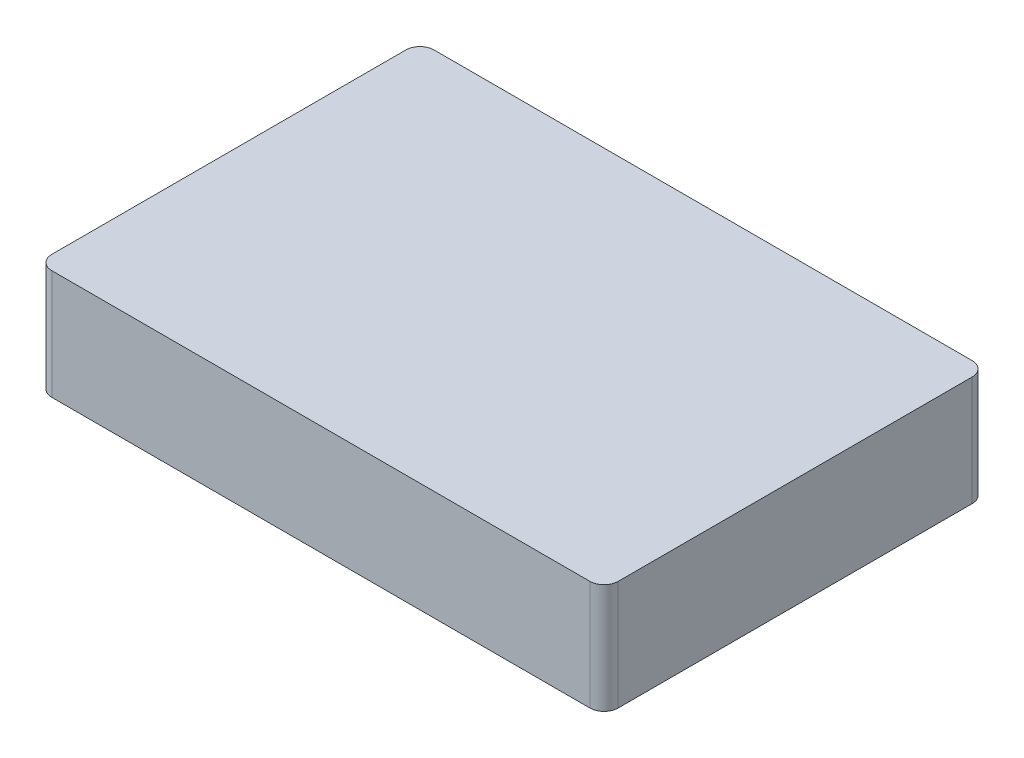
ISO-10303-21;
HEADER;
FILE_DESCRIPTION(('STEP AP214'),'2;1');
FILE_NAME('part.step','',(''),(''),'','','');
FILE_SCHEMA(('AUTOMOTIVE_DESIGN { 1 0 10303 214 1 1 1 1 }'));
ENDSEC;
DATA;
#1=APPLICATION_CONTEXT('core data for automotive mechanical design processes');
#2=APPLICATION_PROTOCOL_DEFINITION('international standard','automotive_design',2000,#1);
#3=PRODUCT_CONTEXT('',#1,'mechanical');
#4=PRODUCT('Part','Part','',(#3));
#5=PRODUCT_RELATED_PRODUCT_CATEGORY('part','',(#4));
#6=PRODUCT_DEFINITION_FORMATION('','',#4);
#7=PRODUCT_DEFINITION_CONTEXT('part definition',#1,'design');
#8=PRODUCT_DEFINITION('design','',#6,#7);
#9=PRODUCT_DEFINITION_SHAPE('','',#8);
#10=(LENGTH_UNIT() NAMED_UNIT(*) SI_UNIT(.MILLI.,.METRE.));
#11=(NAMED_UNIT(*) PLANE_ANGLE_UNIT() SI_UNIT($,.RADIAN.));
#12=(NAMED_UNIT(*) SI_UNIT($,.STERADIAN.) SOLID_ANGLE_UNIT());
#13=UNCERTAINTY_MEASURE_WITH_UNIT(LENGTH_MEASURE(1.E-05),#10,'distance_accuracy_value','');
#14=(GEOMETRIC_REPRESENTATION_CONTEXT(3) GLOBAL_UNCERTAINTY_ASSIGNED_CONTEXT((#13)) GLOBAL_UNIT_ASSIGNED_CONTEXT((#10,
#11,#12)) REPRESENTATION_CONTEXT('',''));
#15=CARTESIAN_POINT('',(0.,0.,0.));
#16=DIRECTION('',(0.,0.,1.));
#17=DIRECTION('',(1.,0.,0.));
#18=AXIS2_PLACEMENT_3D('',#15,#16,#17);
#19=CARTESIAN_POINT('',(0.,15.5,0.));
#20=DIRECTION('',(1.,0.,0.));
#21=DIRECTION('',(0.,0.,-1.));
#22=AXIS2_PLACEMENT_3D('',#19,#20,#21);
#23=PLANE('',#22);
#24=DIRECTION('',(0.,0.,1.));
#25=VECTOR('',#24,1.);
#26=CARTESIAN_POINT('',(0.,15.5,0.));
#27=LINE('',#26,#25);
#28=CARTESIAN_POINT('',(0.,15.5,-52.));
#29=VERTEX_POINT('',#28);
#30=CARTESIAN_POINT('',(0.,15.5,-2.));
#31=VERTEX_POINT('',#30);
#32=EDGE_CURVE('E117',#29,#31,#27,.T.);
#33=ORIENTED_EDGE('',*,*,#32,.F.);
#34=DIRECTION('',(0.,-1.,0.));
#35=VECTOR('',#34,1.);
#36=CARTESIAN_POINT('',(0.,15.5,-52.));
#37=LINE('',#36,#35);
#38=CARTESIAN_POINT('',(0.,0.,-52.));
#39=VERTEX_POINT('',#38);
#40=EDGE_CURVE('E102',#29,#39,#37,.T.);
#41=ORIENTED_EDGE('',*,*,#40,.T.);
#42=DIRECTION('',(0.,0.,1.));
#43=VECTOR('',#42,1.);
#44=CARTESIAN_POINT('',(0.,0.,0.));
#45=LINE('',#44,#43);
#46=CARTESIAN_POINT('',(0.,0.,-2.));
#47=VERTEX_POINT('',#46);
#48=EDGE_CURVE('E114',#39,#47,#45,.T.);
#49=ORIENTED_EDGE('',*,*,#48,.T.);
#50=DIRECTION('',(0.,-1.,0.));
#51=VECTOR('',#50,1.);
#52=CARTESIAN_POINT('',(0.,15.5,-2.));
#53=LINE('',#52,#51);
#54=EDGE_CURVE('E119',#47,#31,#53,.F.);
#55=ORIENTED_EDGE('',*,*,#54,.T.);
#56=EDGE_LOOP('',(#33,#41,#49,#55));
#57=FACE_BOUND('',#56,.T.);
#58=ADVANCED_FACE('F33',(#57),#23,.F.);
#59=CARTESIAN_POINT('',(0.,15.5,0.));
#60=DIRECTION('',(0.,0.,-1.));
#61=DIRECTION('',(-1.,0.,0.));
#62=AXIS2_PLACEMENT_3D('',#59,#60,#61);
#63=PLANE('',#62);
#64=DIRECTION('',(1.,0.,0.));
#65=VECTOR('',#64,1.);
#66=CARTESIAN_POINT('',(0.,15.5,0.));
#67=LINE('',#66,#65);
#68=CARTESIAN_POINT('',(2.,15.5,0.));
#69=VERTEX_POINT('',#68);
#70=CARTESIAN_POINT('',(78.,15.5,0.));
#71=VERTEX_POINT('',#70);
#72=EDGE_CURVE('E168',#69,#71,#67,.T.);
#73=ORIENTED_EDGE('',*,*,#72,.F.);
#74=DIRECTION('',(0.,-1.,0.));
#75=VECTOR('',#74,1.);
#76=CARTESIAN_POINT('',(2.,15.5,0.));
#77=LINE('',#76,#75);
#78=CARTESIAN_POINT('',(2.,0.,0.));
#79=VERTEX_POINT('',#78);
#80=EDGE_CURVE('E152',#69,#79,#77,.T.);
#81=ORIENTED_EDGE('',*,*,#80,.T.);
#82=DIRECTION('',(1.,0.,0.));
#83=VECTOR('',#82,1.);
#84=CARTESIAN_POINT('',(0.,0.,0.));
#85=LINE('',#84,#83);
#86=CARTESIAN_POINT('',(78.,0.,0.));
#87=VERTEX_POINT('',#86);
#88=EDGE_CURVE('E123',#79,#87,#85,.T.);
#89=ORIENTED_EDGE('',*,*,#88,.T.);
#90=DIRECTION('',(0.,-1.,0.));
#91=VECTOR('',#90,1.);
#92=CARTESIAN_POINT('',(78.,15.5,0.));
#93=LINE('',#92,#91);
#94=EDGE_CURVE('E150',#87,#71,#93,.F.);
#95=ORIENTED_EDGE('',*,*,#94,.T.);
#96=EDGE_LOOP('',(#73,#81,#89,#95));
#97=FACE_BOUND('',#96,.T.);
#98=ADVANCED_FACE('F178',(#97),#63,.F.);
#99=CARTESIAN_POINT('',(80.,15.5,0.));
#100=DIRECTION('',(-1.,0.,0.));
#101=DIRECTION('',(0.,0.,1.));
#102=AXIS2_PLACEMENT_3D('',#99,#100,#101);
#103=PLANE('',#102);
#104=DIRECTION('',(0.,0.,-1.));
#105=VECTOR('',#104,1.);
#106=CARTESIAN_POINT('',(80.,0.,0.));
#107=LINE('',#106,#105);
#108=CARTESIAN_POINT('',(80.,0.,-2.));
#109=VERTEX_POINT('',#108);
#110=CARTESIAN_POINT('',(80.,0.,-52.));
#111=VERTEX_POINT('',#110);
#112=EDGE_CURVE('E126',#109,#111,#107,.T.);
#113=ORIENTED_EDGE('',*,*,#112,.T.);
#114=DIRECTION('',(0.,-1.,0.));
#115=VECTOR('',#114,1.);
#116=CARTESIAN_POINT('',(80.,15.5,-52.));
#117=LINE('',#116,#115);
#118=CARTESIAN_POINT('',(80.,15.5,-52.));
#119=VERTEX_POINT('',#118);
#120=EDGE_CURVE('E11',#111,#119,#117,.F.);
#121=ORIENTED_EDGE('',*,*,#120,.T.);
#122=DIRECTION('',(0.,0.,-1.));
#123=VECTOR('',#122,1.);
#124=CARTESIAN_POINT('',(80.,15.5,0.));
#125=LINE('',#124,#123);
#126=CARTESIAN_POINT('',(80.,15.5,-2.));
#127=VERTEX_POINT('',#126);
#128=EDGE_CURVE('E158',#127,#119,#125,.T.);
#129=ORIENTED_EDGE('',*,*,#128,.F.);
#130=DIRECTION('',(0.,-1.,0.));
#131=VECTOR('',#130,1.);
#132=CARTESIAN_POINT('',(80.,15.5,-2.));
#133=LINE('',#132,#131);
#134=EDGE_CURVE('E41',#127,#109,#133,.T.);
#135=ORIENTED_EDGE('',*,*,#134,.T.);
#136=EDGE_LOOP('',(#113,#121,#129,#135));
#137=FACE_BOUND('',#136,.T.);
#138=ADVANCED_FACE('F157',(#137),#103,.F.);
#139=CARTESIAN_POINT('',(0.,15.5,-54.));
#140=DIRECTION('',(0.,0.,1.));
#141=DIRECTION('',(1.,0.,0.));
#142=AXIS2_PLACEMENT_3D('',#139,#140,#141);
#143=PLANE('',#142);
#144=DIRECTION('',(-1.,0.,0.));
#145=VECTOR('',#144,1.);
#146=CARTESIAN_POINT('',(0.,0.,-54.));
#147=LINE('',#146,#145);
#148=CARTESIAN_POINT('',(78.,0.,-54.));
#149=VERTEX_POINT('',#148);
#150=CARTESIAN_POINT('',(2.,0.,-54.));
#151=VERTEX_POINT('',#150);
#152=EDGE_CURVE('E133',#149,#151,#147,.T.);
#153=ORIENTED_EDGE('',*,*,#152,.T.);
#154=DIRECTION('',(0.,-1.,0.));
#155=VECTOR('',#154,1.);
#156=CARTESIAN_POINT('',(2.,15.5,-54.));
#157=LINE('',#156,#155);
#158=CARTESIAN_POINT('',(2.,15.5,-54.));
#159=VERTEX_POINT('',#158);
#160=EDGE_CURVE('E103',#151,#159,#157,.F.);
#161=ORIENTED_EDGE('',*,*,#160,.T.);
#162=DIRECTION('',(-1.,0.,0.));
#163=VECTOR('',#162,1.);
#164=CARTESIAN_POINT('',(0.,15.5,-54.));
#165=LINE('',#164,#163);
#166=CARTESIAN_POINT('',(78.,15.5,-54.));
#167=VERTEX_POINT('',#166);
#168=EDGE_CURVE('E129',#167,#159,#165,.T.);
#169=ORIENTED_EDGE('',*,*,#168,.F.);
#170=DIRECTION('',(0.,-1.,0.));
#171=VECTOR('',#170,1.);
#172=CARTESIAN_POINT('',(78.,15.5,-54.));
#173=LINE('',#172,#171);
#174=EDGE_CURVE('E108',#167,#149,#173,.T.);
#175=ORIENTED_EDGE('',*,*,#174,.T.);
#176=EDGE_LOOP('',(#153,#161,#169,#175));
#177=FACE_BOUND('',#176,.T.);
#178=ADVANCED_FACE('F166',(#177),#143,.F.);
#179=CARTESIAN_POINT('',(0.,15.5,0.));
#180=DIRECTION('',(0.,-1.,0.));
#181=DIRECTION('',(0.,0.,-1.));
#182=AXIS2_PLACEMENT_3D('',#179,#180,#181);
#183=PLANE('',#182);
#184=ORIENTED_EDGE('',*,*,#168,.T.);
#185=CARTESIAN_POINT('',(2.,15.5,-52.));
#186=DIRECTION('',(0.,-1.,0.));
#187=DIRECTION('',(0.,0.,-1.));
#188=AXIS2_PLACEMENT_3D('',#185,#186,#187);
#189=CIRCLE('',#188,2.);
#190=EDGE_CURVE('E148',#159,#29,#189,.F.);
#191=ORIENTED_EDGE('',*,*,#190,.T.);
#192=ORIENTED_EDGE('',*,*,#32,.T.);
#193=CARTESIAN_POINT('',(2.,15.5,-2.));
#194=DIRECTION('',(0.,-1.,0.));
#195=DIRECTION('',(0.,0.,-1.));
#196=AXIS2_PLACEMENT_3D('',#193,#194,#195);
#197=CIRCLE('',#196,2.);
#198=EDGE_CURVE('E146',#31,#69,#197,.F.);
#199=ORIENTED_EDGE('',*,*,#198,.T.);
#200=ORIENTED_EDGE('',*,*,#72,.T.);
#201=CARTESIAN_POINT('',(78.,15.5,-2.));
#202=DIRECTION('',(0.,-1.,0.));
#203=DIRECTION('',(0.,0.,-1.));
#204=AXIS2_PLACEMENT_3D('',#201,#202,#203);
#205=CIRCLE('',#204,2.);
#206=EDGE_CURVE('E53',#71,#127,#205,.F.);
#207=ORIENTED_EDGE('',*,*,#206,.T.);
#208=ORIENTED_EDGE('',*,*,#128,.T.);
#209=CARTESIAN_POINT('',(78.,15.5,-52.));
#210=DIRECTION('',(0.,-1.,0.));
#211=DIRECTION('',(0.,0.,-1.));
#212=AXIS2_PLACEMENT_3D('',#209,#210,#211);
#213=CIRCLE('',#212,2.);
#214=EDGE_CURVE('E144',#119,#167,#213,.F.);
#215=ORIENTED_EDGE('',*,*,#214,.T.);
#216=EDGE_LOOP('',(#184,#191,#192,#199,#200,#207,#208,#215));
#217=FACE_BOUND('',#216,.T.);
#218=ADVANCED_FACE('F172',(#217),#183,.F.);
#219=CARTESIAN_POINT('',(0.,0.,0.));
#220=DIRECTION('',(0.,-1.,0.));
#221=DIRECTION('',(0.,0.,-1.));
#222=AXIS2_PLACEMENT_3D('',#219,#220,#221);
#223=PLANE('',#222);
#224=ORIENTED_EDGE('',*,*,#48,.F.);
#225=CARTESIAN_POINT('',(2.,0.,-52.));
#226=DIRECTION('',(0.,-1.,0.));
#227=DIRECTION('',(0.,0.,-1.));
#228=AXIS2_PLACEMENT_3D('',#225,#226,#227);
#229=CIRCLE('',#228,2.);
#230=EDGE_CURVE('E98',#39,#151,#229,.T.);
#231=ORIENTED_EDGE('',*,*,#230,.T.);
#232=ORIENTED_EDGE('',*,*,#152,.F.);
#233=CARTESIAN_POINT('',(78.,0.,-52.));
#234=DIRECTION('',(0.,-1.,0.));
#235=DIRECTION('',(0.,0.,-1.));
#236=AXIS2_PLACEMENT_3D('',#233,#234,#235);
#237=CIRCLE('',#236,2.);
#238=EDGE_CURVE('E137',#149,#111,#237,.T.);
#239=ORIENTED_EDGE('',*,*,#238,.T.);
#240=ORIENTED_EDGE('',*,*,#112,.F.);
#241=CARTESIAN_POINT('',(78.,0.,-2.));
#242=DIRECTION('',(0.,-1.,0.));
#243=DIRECTION('',(0.,0.,-1.));
#244=AXIS2_PLACEMENT_3D('',#241,#242,#243);
#245=CIRCLE('',#244,2.);
#246=EDGE_CURVE('E118',#109,#87,#245,.T.);
#247=ORIENTED_EDGE('',*,*,#246,.T.);
#248=ORIENTED_EDGE('',*,*,#88,.F.);
#249=CARTESIAN_POINT('',(2.,0.,-2.));
#250=DIRECTION('',(0.,-1.,0.));
#251=DIRECTION('',(0.,0.,-1.));
#252=AXIS2_PLACEMENT_3D('',#249,#250,#251);
#253=CIRCLE('',#252,2.);
#254=EDGE_CURVE('E109',#79,#47,#253,.T.);
#255=ORIENTED_EDGE('',*,*,#254,.T.);
#256=EDGE_LOOP('',(#224,#231,#232,#239,#240,#247,#248,#255));
#257=FACE_BOUND('',#256,.T.);
#258=ADVANCED_FACE('F121',(#257),#223,.T.);
#259=CARTESIAN_POINT('',(2.,15.5,-52.));
#260=DIRECTION('',(0.,-1.,0.));
#261=DIRECTION('',(0.,0.,-1.));
#262=AXIS2_PLACEMENT_3D('',#259,#260,#261);
#263=CYLINDRICAL_SURFACE('',#262,2.);
#264=ORIENTED_EDGE('',*,*,#190,.F.);
#265=ORIENTED_EDGE('',*,*,#160,.F.);
#266=ORIENTED_EDGE('',*,*,#230,.F.);
#267=ORIENTED_EDGE('',*,*,#40,.F.);
#268=EDGE_LOOP('',(#264,#265,#266,#267));
#269=FACE_BOUND('',#268,.T.);
#270=ADVANCED_FACE('F101',(#269),#263,.T.);
#271=CARTESIAN_POINT('',(2.,15.5,-2.));
#272=DIRECTION('',(0.,-1.,0.));
#273=DIRECTION('',(0.,0.,-1.));
#274=AXIS2_PLACEMENT_3D('',#271,#272,#273);
#275=CYLINDRICAL_SURFACE('',#274,2.);
#276=ORIENTED_EDGE('',*,*,#198,.F.);
#277=ORIENTED_EDGE('',*,*,#54,.F.);
#278=ORIENTED_EDGE('',*,*,#254,.F.);
#279=ORIENTED_EDGE('',*,*,#80,.F.);
#280=EDGE_LOOP('',(#276,#277,#278,#279));
#281=FACE_BOUND('',#280,.T.);
#282=ADVANCED_FACE('F176',(#281),#275,.T.);
#283=CARTESIAN_POINT('',(78.,15.5,-52.));
#284=DIRECTION('',(0.,-1.,0.));
#285=DIRECTION('',(0.,0.,-1.));
#286=AXIS2_PLACEMENT_3D('',#283,#284,#285);
#287=CYLINDRICAL_SURFACE('',#286,2.);
#288=ORIENTED_EDGE('',*,*,#214,.F.);
#289=ORIENTED_EDGE('',*,*,#120,.F.);
#290=ORIENTED_EDGE('',*,*,#238,.F.);
#291=ORIENTED_EDGE('',*,*,#174,.F.);
#292=EDGE_LOOP('',(#288,#289,#290,#291));
#293=FACE_BOUND('',#292,.T.);
#294=ADVANCED_FACE('F163',(#293),#287,.T.);
#295=CARTESIAN_POINT('',(78.,15.5,-2.));
#296=DIRECTION('',(0.,-1.,0.));
#297=DIRECTION('',(0.,0.,-1.));
#298=AXIS2_PLACEMENT_3D('',#295,#296,#297);
#299=CYLINDRICAL_SURFACE('',#298,2.);
#300=ORIENTED_EDGE('',*,*,#206,.F.);
#301=ORIENTED_EDGE('',*,*,#94,.F.);
#302=ORIENTED_EDGE('',*,*,#246,.F.);
#303=ORIENTED_EDGE('',*,*,#134,.F.);
#304=EDGE_LOOP('',(#300,#301,#302,#303));
#305=FACE_BOUND('',#304,.T.);
#306=ADVANCED_FACE('F35',(#305),#299,.T.);
#307=CLOSED_SHELL('',(#58,#98,#138,#178,#218,#258,#270,#282,#294,#306));
#308=MANIFOLD_SOLID_BREP('B2',#307);
#309=ADVANCED_BREP_SHAPE_REPRESENTATION('',(#18,#308),#14);
#310=SHAPE_DEFINITION_REPRESENTATION(#9,#309);
ENDSEC;
END-ISO-10303-21;
